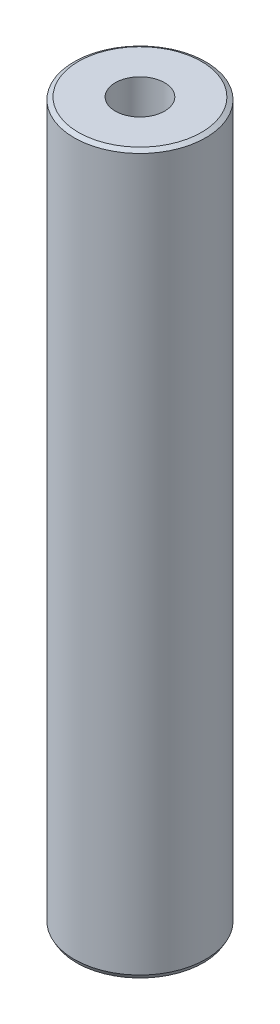
ISO-10303-21;
HEADER;
FILE_DESCRIPTION(('STEP AP214'),'2;1');
FILE_NAME('part.step','',(''),(''),'','','');
FILE_SCHEMA(('AUTOMOTIVE_DESIGN { 1 0 10303 214 1 1 1 1 }'));
ENDSEC;
DATA;
#1=APPLICATION_CONTEXT('core data for automotive mechanical design processes');
#2=APPLICATION_PROTOCOL_DEFINITION('international standard','automotive_design',2000,#1);
#3=PRODUCT_CONTEXT('',#1,'mechanical');
#4=PRODUCT('Part','Part','',(#3));
#5=PRODUCT_RELATED_PRODUCT_CATEGORY('part','',(#4));
#6=PRODUCT_DEFINITION_FORMATION('','',#4);
#7=PRODUCT_DEFINITION_CONTEXT('part definition',#1,'design');
#8=PRODUCT_DEFINITION('design','',#6,#7);
#9=PRODUCT_DEFINITION_SHAPE('','',#8);
#10=(LENGTH_UNIT() NAMED_UNIT(*) SI_UNIT(.MILLI.,.METRE.));
#11=(NAMED_UNIT(*) PLANE_ANGLE_UNIT() SI_UNIT($,.RADIAN.));
#12=(NAMED_UNIT(*) SI_UNIT($,.STERADIAN.) SOLID_ANGLE_UNIT());
#13=UNCERTAINTY_MEASURE_WITH_UNIT(LENGTH_MEASURE(1.E-05),#10,'distance_accuracy_value','');
#14=(GEOMETRIC_REPRESENTATION_CONTEXT(3) GLOBAL_UNCERTAINTY_ASSIGNED_CONTEXT((#13)) GLOBAL_UNIT_ASSIGNED_CONTEXT((#10,
#11,#12)) REPRESENTATION_CONTEXT('',''));
#15=CARTESIAN_POINT('',(0.,0.,0.));
#16=DIRECTION('',(0.,0.,1.));
#17=DIRECTION('',(1.,0.,0.));
#18=AXIS2_PLACEMENT_3D('',#15,#16,#17);
#19=CARTESIAN_POINT('',(0.,600.,0.));
#20=DIRECTION('',(0.,-1.,0.));
#21=DIRECTION('',(0.,0.,-1.));
#22=AXIS2_PLACEMENT_3D('',#19,#20,#21);
#23=CYLINDRICAL_SURFACE('',#22,55.);
#24=CARTESIAN_POINT('',(0.,597.94545296518,0.));
#25=DIRECTION('',(0.,1.,0.));
#26=DIRECTION('',(0.,0.,1.));
#27=AXIS2_PLACEMENT_3D('',#24,#25,#26);
#28=CIRCLE('',#27,55.);
#29=CARTESIAN_POINT('',(0.,597.94545296518,55.));
#30=VERTEX_POINT('',#29);
#31=EDGE_CURVE('E50',#30,#30,#28,.F.);
#32=ORIENTED_EDGE('',*,*,#31,.T.);
#33=EDGE_LOOP('',(#32));
#34=FACE_BOUND('',#33,.T.);
#35=CARTESIAN_POINT('',(0.,3.61183850690805,0.));
#36=DIRECTION('',(0.,1.,0.));
#37=DIRECTION('',(0.,0.,1.));
#38=AXIS2_PLACEMENT_3D('',#35,#36,#37);
#39=CIRCLE('',#38,55.);
#40=CARTESIAN_POINT('',(0.,3.61183850690805,55.));
#41=VERTEX_POINT('',#40);
#42=EDGE_CURVE('E51',#41,#41,#39,.T.);
#43=ORIENTED_EDGE('',*,*,#42,.T.);
#44=EDGE_LOOP('',(#43));
#45=FACE_BOUND('',#44,.T.);
#46=ADVANCED_FACE('F39',(#34,#45),#23,.T.);
#47=CARTESIAN_POINT('',(0.,600.,0.));
#48=DIRECTION('',(0.,1.,0.));
#49=DIRECTION('',(0.,0.,1.));
#50=AXIS2_PLACEMENT_3D('',#47,#48,#49);
#51=PLANE('',#50);
#52=CARTESIAN_POINT('',(0.,600.,0.));
#53=DIRECTION('',(0.,1.,0.));
#54=DIRECTION('',(0.,0.,1.));
#55=AXIS2_PLACEMENT_3D('',#52,#53,#54);
#56=CIRCLE('',#55,51.3881614930919);
#57=CARTESIAN_POINT('',(0.,600.,51.3881614930919));
#58=VERTEX_POINT('',#57);
#59=EDGE_CURVE('E54',#58,#58,#56,.T.);
#60=ORIENTED_EDGE('',*,*,#59,.T.);
#61=EDGE_LOOP('',(#60));
#62=FACE_BOUND('',#61,.T.);
#63=CARTESIAN_POINT('',(0.,600.,0.));
#64=DIRECTION('',(0.,1.,0.));
#65=DIRECTION('',(0.,0.,1.));
#66=AXIS2_PLACEMENT_3D('',#63,#64,#65);
#67=CIRCLE('',#66,20.6025283733356);
#68=CARTESIAN_POINT('',(0.,600.,20.6025283733356));
#69=VERTEX_POINT('',#68);
#70=EDGE_CURVE('E58',#69,#69,#67,.T.);
#71=ORIENTED_EDGE('',*,*,#70,.F.);
#72=EDGE_LOOP('',(#71));
#73=FACE_BOUND('',#72,.T.);
#74=ADVANCED_FACE('F69',(#62,#73),#51,.T.);
#75=CARTESIAN_POINT('',(0.,0.,0.));
#76=DIRECTION('',(0.,1.,0.));
#77=DIRECTION('',(0.,0.,1.));
#78=AXIS2_PLACEMENT_3D('',#75,#76,#77);
#79=PLANE('',#78);
#80=CARTESIAN_POINT('',(0.,0.,0.));
#81=DIRECTION('',(0.,1.,0.));
#82=DIRECTION('',(0.,0.,1.));
#83=AXIS2_PLACEMENT_3D('',#80,#81,#82);
#84=CIRCLE('',#83,52.9454529651802);
#85=CARTESIAN_POINT('',(0.,0.,52.9454529651802));
#86=VERTEX_POINT('',#85);
#87=EDGE_CURVE('E10',#86,#86,#84,.F.);
#88=ORIENTED_EDGE('',*,*,#87,.T.);
#89=EDGE_LOOP('',(#88));
#90=FACE_BOUND('',#89,.T.);
#91=CARTESIAN_POINT('',(0.,0.,0.));
#92=DIRECTION('',(0.,1.,0.));
#93=DIRECTION('',(0.,0.,1.));
#94=AXIS2_PLACEMENT_3D('',#91,#92,#93);
#95=CIRCLE('',#94,20.6025283733356);
#96=CARTESIAN_POINT('',(0.,0.,20.6025283733356));
#97=VERTEX_POINT('',#96);
#98=EDGE_CURVE('E63',#97,#97,#95,.T.);
#99=ORIENTED_EDGE('',*,*,#98,.T.);
#100=EDGE_LOOP('',(#99));
#101=FACE_BOUND('',#100,.T.);
#102=ADVANCED_FACE('F75',(#90,#101),#79,.F.);
#103=CARTESIAN_POINT('',(0.,600.,0.));
#104=DIRECTION('',(0.,-1.,0.));
#105=DIRECTION('',(0.,0.,-1.));
#106=AXIS2_PLACEMENT_3D('',#103,#104,#105);
#107=CYLINDRICAL_SURFACE('',#106,20.6025283733356);
#108=ORIENTED_EDGE('',*,*,#70,.T.);
#109=EDGE_LOOP('',(#108));
#110=FACE_BOUND('',#109,.T.);
#111=ORIENTED_EDGE('',*,*,#98,.F.);
#112=EDGE_LOOP('',(#111));
#113=FACE_BOUND('',#112,.T.);
#114=ADVANCED_FACE('F70',(#110,#113),#107,.F.);
#115=CARTESIAN_POINT('',(0.,600.,0.));
#116=DIRECTION('',(0.,-1.,0.));
#117=DIRECTION('',(0.,0.,-1.));
#118=AXIS2_PLACEMENT_3D('',#115,#116,#117);
#119=CONICAL_SURFACE('',#118,51.3881614930919,1.05360611199932);
#120=ORIENTED_EDGE('',*,*,#31,.F.);
#121=EDGE_LOOP('',(#120));
#122=FACE_BOUND('',#121,.T.);
#123=ORIENTED_EDGE('',*,*,#59,.F.);
#124=EDGE_LOOP('',(#123));
#125=FACE_BOUND('',#124,.T.);
#126=ADVANCED_FACE('F81',(#122,#125),#119,.T.);
#127=CARTESIAN_POINT('',(0.,3.61183850690805,0.));
#128=DIRECTION('',(0.,1.,0.));
#129=DIRECTION('',(0.,0.,1.));
#130=AXIS2_PLACEMENT_3D('',#127,#128,#129);
#131=CONICAL_SURFACE('',#130,55.,0.517190214795577);
#132=CARTESIAN_POINT('',(0.,0.,52.9454529651802));
#133=CARTESIAN_POINT('',(0.,0.0376233177802924,52.9668544967929));
#134=CARTESIAN_POINT('',(0.,0.0752466355605843,52.9882560284056));
#135=CARTESIAN_POINT('',(0.,0.150493271121168,53.031059091631));
#136=CARTESIAN_POINT('',(0.,0.18811658890146,53.0524606232437));
#137=CARTESIAN_POINT('',(0.,0.263363224462045,53.0952636864691));
#138=CARTESIAN_POINT('',(0.,0.300986542242337,53.1166652180818));
#139=CARTESIAN_POINT('',(0.,0.376233177802922,53.1594682813072));
#140=CARTESIAN_POINT('',(0.,0.413856495583214,53.1808698129199));
#141=CARTESIAN_POINT('',(0.,0.489103131143798,53.2236728761454));
#142=CARTESIAN_POINT('',(0.,0.52672644892409,53.2450744077581));
#143=CARTESIAN_POINT('',(0.,0.601973084484674,53.2878774709835));
#144=CARTESIAN_POINT('',(0.,0.639596402264966,53.3092790025962));
#145=CARTESIAN_POINT('',(0.,0.714843037825551,53.3520820658216));
#146=CARTESIAN_POINT('',(0.,0.752466355605844,53.3734835974343));
#147=CARTESIAN_POINT('',(0.,0.827712991166428,53.4162866606597));
#148=CARTESIAN_POINT('',(0.,0.86533630894672,53.4376881922724));
#149=CARTESIAN_POINT('',(0.,0.940582944507304,53.4804912554978));
#150=CARTESIAN_POINT('',(0.,0.978206262287596,53.5018927871105));
#151=CARTESIAN_POINT('',(0.,1.05345289784818,53.5446958503359));
#152=CARTESIAN_POINT('',(0.,1.09107621562847,53.5660973819487));
#153=CARTESIAN_POINT('',(0.,1.16632285118906,53.6089004451741));
#154=CARTESIAN_POINT('',(0.,1.20394616896935,53.6303019767868));
#155=CARTESIAN_POINT('',(0.,1.27919280452993,53.6731050400122));
#156=CARTESIAN_POINT('',(0.,1.31681612231023,53.6945065716249));
#157=CARTESIAN_POINT('',(0.,1.39206275787081,53.7373096348503));
#158=CARTESIAN_POINT('',(0.,1.4296860756511,53.758711166463));
#159=CARTESIAN_POINT('',(0.,1.50493271121169,53.8015142296884));
#160=CARTESIAN_POINT('',(0.,1.54255602899198,53.8229157613011));
#161=CARTESIAN_POINT('',(0.,1.61780266455256,53.8657188245266));
#162=CARTESIAN_POINT('',(0.,1.65542598233285,53.8871203561393));
#163=CARTESIAN_POINT('',(0.,1.73067261789344,53.9299234193647));
#164=CARTESIAN_POINT('',(0.,1.76829593567373,53.9513249509774));
#165=CARTESIAN_POINT('',(0.,1.84354257123432,53.9941280142028));
#166=CARTESIAN_POINT('',(0.,1.88116588901461,54.0155295458155));
#167=CARTESIAN_POINT('',(0.,1.95641252457519,54.0583326090409));
#168=CARTESIAN_POINT('',(0.,1.99403584235549,54.0797341406536));
#169=CARTESIAN_POINT('',(0.,2.06928247791607,54.122537203879));
#170=CARTESIAN_POINT('',(0.,2.10690579569636,54.1439387354917));
#171=CARTESIAN_POINT('',(0.,2.18215243125695,54.1867417987172));
#172=CARTESIAN_POINT('',(0.,2.21977574903724,54.2081433303299));
#173=CARTESIAN_POINT('',(0.,2.29502238459782,54.2509463935553));
#174=CARTESIAN_POINT('',(0.,2.33264570237812,54.272347925168));
#175=CARTESIAN_POINT('',(0.,2.4078923379387,54.3151509883934));
#176=CARTESIAN_POINT('',(0.,2.44551565571899,54.3365525200061));
#177=CARTESIAN_POINT('',(0.,2.52076229127958,54.3793555832315));
#178=CARTESIAN_POINT('',(0.,2.55838560905987,54.4007571148442));
#179=CARTESIAN_POINT('',(0.,2.63363224462045,54.4435601780696));
#180=CARTESIAN_POINT('',(0.,2.67125556240074,54.4649617096823));
#181=CARTESIAN_POINT('',(0.,2.74650219796133,54.5077647729077));
#182=CARTESIAN_POINT('',(0.,2.78412551574162,54.5291663045205));
#183=CARTESIAN_POINT('',(0.,2.85937215130221,54.5719693677459));
#184=CARTESIAN_POINT('',(0.,2.8969954690825,54.5933708993586));
#185=CARTESIAN_POINT('',(0.,2.97224210464308,54.636173962584));
#186=CARTESIAN_POINT('',(0.,3.00986542242337,54.6575754941967));
#187=CARTESIAN_POINT('',(0.,3.08511205798396,54.7003785574221));
#188=CARTESIAN_POINT('',(0.,3.12273537576425,54.7217800890348));
#189=CARTESIAN_POINT('',(0.,3.19798201132483,54.7645831522602));
#190=CARTESIAN_POINT('',(0.,3.23560532910513,54.7859846838729));
#191=CARTESIAN_POINT('',(0.,3.31085196466571,54.8287877470983));
#192=CARTESIAN_POINT('',(0.,3.348475282446,54.8501892787111));
#193=CARTESIAN_POINT('',(0.,3.42372191800659,54.8929923419365));
#194=CARTESIAN_POINT('',(0.,3.46134523578688,54.9143938735492));
#195=CARTESIAN_POINT('',(0.,3.53659187134746,54.9571969367746));
#196=CARTESIAN_POINT('',(0.,3.57421518912776,54.9785984683873));
#197=CARTESIAN_POINT('',(0.,3.61183850690805,55.));
#198=B_SPLINE_CURVE_WITH_KNOTS('',3,(#132,#133,#134,#135,#136,#137,#138,#139,#140,#141,#142,
#143,#144,#145,#146,#147,#148,#149,#150,#151,#152,#153,#154,#155,#156,#157,#158,#159,#160,#161,
#162,#163,#164,#165,#166,#167,#168,#169,#170,#171,#172,#173,#174,#175,#176,#177,#178,#179,#180,
#181,#182,#183,#184,#185,#186,#187,#188,#189,#190,#191,#192,#193,#194,#195,#196,#197),
.UNSPECIFIED.,.F.,.F.,(4,2,2,2,2,2,2,2,2,2,2,2,2,2,2,2,2,2,2,2,2,2,2,2,2,2,2,2,2,2,2,2,4),(0.,
0.12985321084016,0.259706421680319,0.389559632520476,0.519412843360636,0.649266054200795,
0.779119265040955,0.908972475881111,1.03882568672127,1.16867889756143,1.29853210840159,
1.42838531924175,1.55823853008191,1.68809174092207,1.81794495176223,1.94779816260239,
2.07765137344254,2.2075045842827,2.33735779512286,2.46721100596302,2.59706421680318,
2.72691742764334,2.8567706384835,2.98662384932366,3.11647706016382,3.24633027100397,
3.37618348184413,3.50603669268429,3.63588990352445,3.76574311436461,3.89559632520477,
4.02544953604493,4.15530274688509),.UNSPECIFIED.);
#199=EDGE_CURVE('BSEAM45',#86,#41,#198,.T.);
#200=ORIENTED_EDGE('',*,*,#87,.F.);
#201=ORIENTED_EDGE('',*,*,#42,.F.);
#202=ORIENTED_EDGE('',*,*,#199,.T.);
#203=ORIENTED_EDGE('',*,*,#199,.F.);
#204=EDGE_LOOP('',(#200,#202,#201,#203));
#205=FACE_BOUND('',#204,.T.);
#206=ADVANCED_FACE('F45',(#205),#131,.T.);
#207=CLOSED_SHELL('',(#46,#74,#102,#114,#126,#206));
#208=MANIFOLD_SOLID_BREP('B2',#207);
#209=ADVANCED_BREP_SHAPE_REPRESENTATION('',(#18,#208),#14);
#210=SHAPE_DEFINITION_REPRESENTATION(#9,#209);
ENDSEC;
END-ISO-10303-21;
